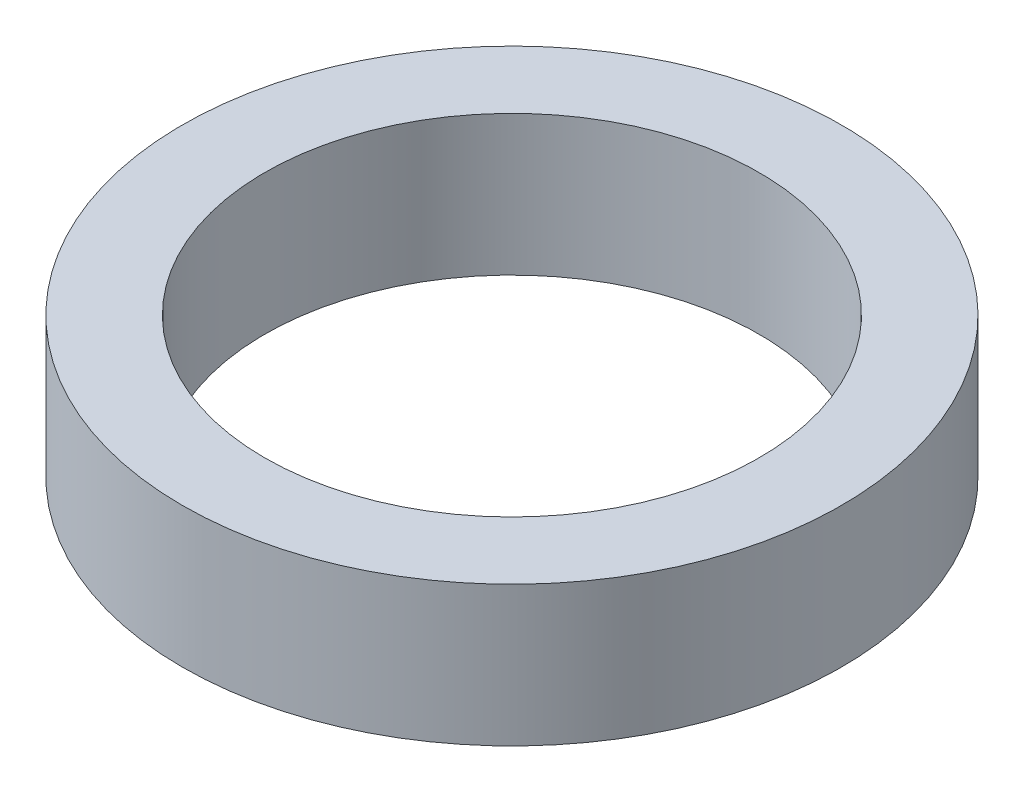
ISO-10303-21;
HEADER;
FILE_DESCRIPTION(('STEP AP214'),'2;1');
FILE_NAME('part.step','',(''),(''),'','','');
FILE_SCHEMA(('AUTOMOTIVE_DESIGN { 1 0 10303 214 1 1 1 1 }'));
ENDSEC;
DATA;
#1=APPLICATION_CONTEXT('core data for automotive mechanical design processes');
#2=APPLICATION_PROTOCOL_DEFINITION('international standard','automotive_design',2000,#1);
#3=PRODUCT_CONTEXT('',#1,'mechanical');
#4=PRODUCT('Part','Part','',(#3));
#5=PRODUCT_RELATED_PRODUCT_CATEGORY('part','',(#4));
#6=PRODUCT_DEFINITION_FORMATION('','',#4);
#7=PRODUCT_DEFINITION_CONTEXT('part definition',#1,'design');
#8=PRODUCT_DEFINITION('design','',#6,#7);
#9=PRODUCT_DEFINITION_SHAPE('','',#8);
#10=(LENGTH_UNIT() NAMED_UNIT(*) SI_UNIT(.MILLI.,.METRE.));
#11=(NAMED_UNIT(*) PLANE_ANGLE_UNIT() SI_UNIT($,.RADIAN.));
#12=(NAMED_UNIT(*) SI_UNIT($,.STERADIAN.) SOLID_ANGLE_UNIT());
#13=UNCERTAINTY_MEASURE_WITH_UNIT(LENGTH_MEASURE(1.E-05),#10,'distance_accuracy_value','');
#14=(GEOMETRIC_REPRESENTATION_CONTEXT(3) GLOBAL_UNCERTAINTY_ASSIGNED_CONTEXT((#13)) GLOBAL_UNIT_ASSIGNED_CONTEXT((#10,
#11,#12)) REPRESENTATION_CONTEXT('',''));
#15=CARTESIAN_POINT('',(0.,0.,0.));
#16=DIRECTION('',(0.,0.,1.));
#17=DIRECTION('',(1.,0.,0.));
#18=AXIS2_PLACEMENT_3D('',#15,#16,#17);
#19=CARTESIAN_POINT('',(0.,17.,0.));
#20=DIRECTION('',(0.,-1.,0.));
#21=DIRECTION('',(0.,0.,-1.));
#22=AXIS2_PLACEMENT_3D('',#19,#20,#21);
#23=CYLINDRICAL_SURFACE('',#22,40.);
#24=CARTESIAN_POINT('',(0.,17.,0.));
#25=DIRECTION('',(0.,1.,0.));
#26=DIRECTION('',(0.,0.,1.));
#27=AXIS2_PLACEMENT_3D('',#24,#25,#26);
#28=CIRCLE('',#27,40.);
#29=CARTESIAN_POINT('',(0.,17.,40.));
#30=VERTEX_POINT('',#29);
#31=EDGE_CURVE('E10',#30,#30,#28,.T.);
#32=ORIENTED_EDGE('',*,*,#31,.F.);
#33=EDGE_LOOP('',(#32));
#34=FACE_BOUND('',#33,.T.);
#35=CARTESIAN_POINT('',(0.,0.,0.));
#36=DIRECTION('',(0.,1.,0.));
#37=DIRECTION('',(0.,0.,1.));
#38=AXIS2_PLACEMENT_3D('',#35,#36,#37);
#39=CIRCLE('',#38,40.);
#40=CARTESIAN_POINT('',(0.,0.,40.));
#41=VERTEX_POINT('',#40);
#42=EDGE_CURVE('E37',#41,#41,#39,.T.);
#43=ORIENTED_EDGE('',*,*,#42,.T.);
#44=EDGE_LOOP('',(#43));
#45=FACE_BOUND('',#44,.T.);
#46=ADVANCED_FACE('F40',(#34,#45),#23,.T.);
#47=CARTESIAN_POINT('',(0.,17.,0.));
#48=DIRECTION('',(0.,1.,0.));
#49=DIRECTION('',(0.,0.,1.));
#50=AXIS2_PLACEMENT_3D('',#47,#48,#49);
#51=PLANE('',#50);
#52=CARTESIAN_POINT('',(0.,17.,0.));
#53=DIRECTION('',(0.,1.,0.));
#54=DIRECTION('',(0.,0.,1.));
#55=AXIS2_PLACEMENT_3D('',#52,#53,#54);
#56=CIRCLE('',#55,30.);
#57=CARTESIAN_POINT('',(0.,17.,30.));
#58=VERTEX_POINT('',#57);
#59=EDGE_CURVE('E50',#58,#58,#56,.T.);
#60=ORIENTED_EDGE('',*,*,#59,.F.);
#61=EDGE_LOOP('',(#60));
#62=FACE_BOUND('',#61,.T.);
#63=ORIENTED_EDGE('',*,*,#31,.T.);
#64=EDGE_LOOP('',(#63));
#65=FACE_BOUND('',#64,.T.);
#66=ADVANCED_FACE('F59',(#62,#65),#51,.T.);
#67=CARTESIAN_POINT('',(0.,0.,0.));
#68=DIRECTION('',(0.,1.,0.));
#69=DIRECTION('',(0.,0.,1.));
#70=AXIS2_PLACEMENT_3D('',#67,#68,#69);
#71=PLANE('',#70);
#72=CARTESIAN_POINT('',(0.,0.,0.));
#73=DIRECTION('',(0.,1.,0.));
#74=DIRECTION('',(0.,0.,1.));
#75=AXIS2_PLACEMENT_3D('',#72,#73,#74);
#76=CIRCLE('',#75,30.);
#77=CARTESIAN_POINT('',(0.,0.,30.));
#78=VERTEX_POINT('',#77);
#79=EDGE_CURVE('E47',#78,#78,#76,.T.);
#80=ORIENTED_EDGE('',*,*,#79,.T.);
#81=EDGE_LOOP('',(#80));
#82=FACE_BOUND('',#81,.T.);
#83=ORIENTED_EDGE('',*,*,#42,.F.);
#84=EDGE_LOOP('',(#83));
#85=FACE_BOUND('',#84,.T.);
#86=ADVANCED_FACE('F58',(#82,#85),#71,.F.);
#87=CARTESIAN_POINT('',(0.,17.,0.));
#88=DIRECTION('',(0.,-1.,0.));
#89=DIRECTION('',(0.,0.,-1.));
#90=AXIS2_PLACEMENT_3D('',#87,#88,#89);
#91=CYLINDRICAL_SURFACE('',#90,30.);
#92=ORIENTED_EDGE('',*,*,#59,.T.);
#93=EDGE_LOOP('',(#92));
#94=FACE_BOUND('',#93,.T.);
#95=ORIENTED_EDGE('',*,*,#79,.F.);
#96=EDGE_LOOP('',(#95));
#97=FACE_BOUND('',#96,.T.);
#98=ADVANCED_FACE('F54',(#94,#97),#91,.F.);
#99=CLOSED_SHELL('',(#46,#66,#86,#98));
#100=MANIFOLD_SOLID_BREP('B2',#99);
#101=ADVANCED_BREP_SHAPE_REPRESENTATION('',(#18,#100),#14);
#102=SHAPE_DEFINITION_REPRESENTATION(#9,#101);
ENDSEC;
END-ISO-10303-21;
